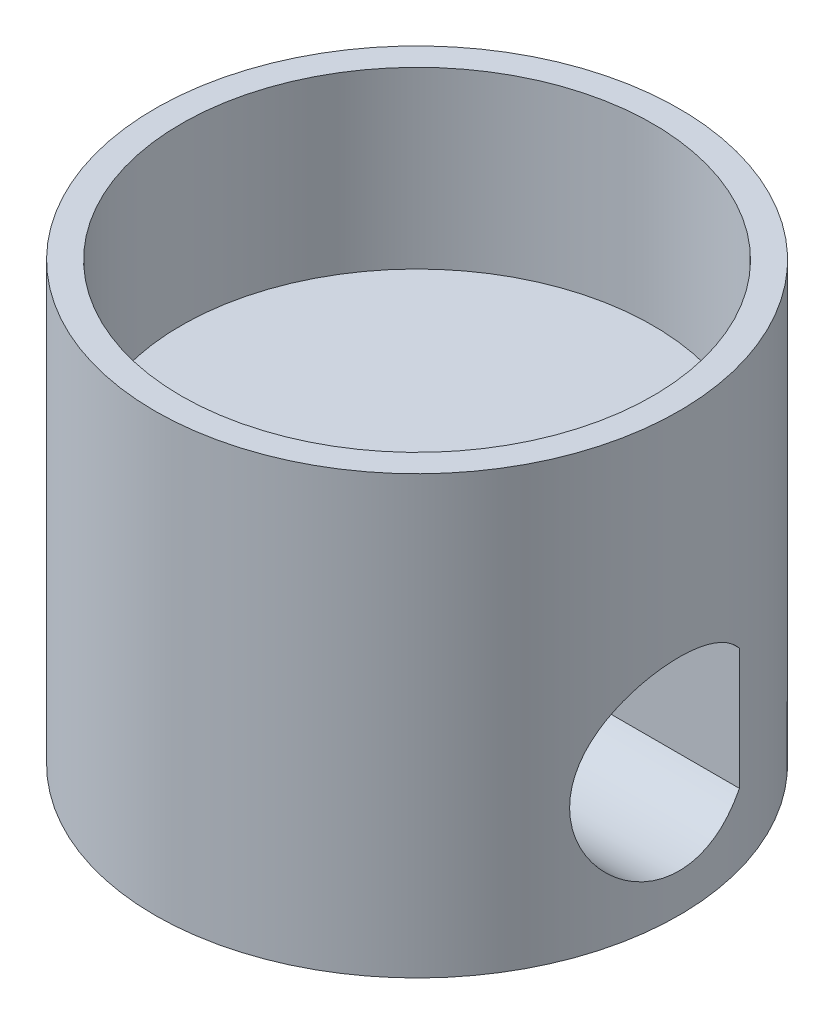
ISO-10303-21;
HEADER;
FILE_DESCRIPTION(('STEP AP214'),'2;1');
FILE_NAME('part.step','',(''),(''),'','','');
FILE_SCHEMA(('AUTOMOTIVE_DESIGN { 1 0 10303 214 1 1 1 1 }'));
ENDSEC;
DATA;
#1=APPLICATION_CONTEXT('core data for automotive mechanical design processes');
#2=APPLICATION_PROTOCOL_DEFINITION('international standard','automotive_design',2000,#1);
#3=PRODUCT_CONTEXT('',#1,'mechanical');
#4=PRODUCT('Part','Part','',(#3));
#5=PRODUCT_RELATED_PRODUCT_CATEGORY('part','',(#4));
#6=PRODUCT_DEFINITION_FORMATION('','',#4);
#7=PRODUCT_DEFINITION_CONTEXT('part definition',#1,'design');
#8=PRODUCT_DEFINITION('design','',#6,#7);
#9=PRODUCT_DEFINITION_SHAPE('','',#8);
#10=(LENGTH_UNIT() NAMED_UNIT(*) SI_UNIT(.MILLI.,.METRE.));
#11=(NAMED_UNIT(*) PLANE_ANGLE_UNIT() SI_UNIT($,.RADIAN.));
#12=(NAMED_UNIT(*) SI_UNIT($,.STERADIAN.) SOLID_ANGLE_UNIT());
#13=UNCERTAINTY_MEASURE_WITH_UNIT(LENGTH_MEASURE(1.E-05),#10,'distance_accuracy_value','');
#14=(GEOMETRIC_REPRESENTATION_CONTEXT(3) GLOBAL_UNCERTAINTY_ASSIGNED_CONTEXT((#13)) GLOBAL_UNIT_ASSIGNED_CONTEXT((#10,
#11,#12)) REPRESENTATION_CONTEXT('',''));
#15=CARTESIAN_POINT('',(0.,0.,0.));
#16=DIRECTION('',(0.,0.,1.));
#17=DIRECTION('',(1.,0.,0.));
#18=AXIS2_PLACEMENT_3D('',#15,#16,#17);
#19=CARTESIAN_POINT('',(0.,25.,0.));
#20=DIRECTION('',(0.,-1.,0.));
#21=DIRECTION('',(0.,0.,-1.));
#22=AXIS2_PLACEMENT_3D('',#19,#20,#21);
#23=CYLINDRICAL_SURFACE('',#22,15.);
#24=DIRECTION('',(0.,-1.,0.));
#25=VECTOR('',#24,1.);
#26=CARTESIAN_POINT('',(-14.456832294801,25.,-4.));
#27=LINE('',#26,#25);
#28=CARTESIAN_POINT('',(-14.456832294801,4.02293226985726,-4.));
#29=VERTEX_POINT('',#28);
#30=CARTESIAN_POINT('',(-14.456832294801,10.9770677301427,-4.));
#31=VERTEX_POINT('',#30);
#32=EDGE_CURVE('E11',#29,#31,#27,.F.);
#33=ORIENTED_EDGE('',*,*,#32,.T.);
#34=CARTESIAN_POINT('',(-14.456832294801,10.9770677301427,-4.));
#35=CARTESIAN_POINT('',(-14.4838123008884,11.0892365045034,-3.90250583243332));
#36=CARTESIAN_POINT('',(-14.5110225627413,11.1972626767375,-3.80030957930546));
#37=CARTESIAN_POINT('',(-14.5651751468478,11.4043998549254,-3.58716135127771));
#38=CARTESIAN_POINT('',(-14.5921174385638,11.5035098549239,-3.47620839105837));
#39=CARTESIAN_POINT('',(-14.6450433181712,11.6923164690028,-3.24602568302507));
#40=CARTESIAN_POINT('',(-14.6710252322394,11.7819971081709,-3.12678244014175));
#41=CARTESIAN_POINT('',(-14.7212791590907,11.9511327678717,-2.88091616818375));
#42=CARTESIAN_POINT('',(-14.7455512518441,12.0305882667891,-2.75429348476022));
#43=CARTESIAN_POINT('',(-14.7917549810737,12.1787797631095,-2.49428161022018));
#44=CARTESIAN_POINT('',(-14.8136834549555,12.247501331881,-2.3608836253124));
#45=CARTESIAN_POINT('',(-14.854560851509,12.3735547551419,-2.08830503918467));
#46=CARTESIAN_POINT('',(-14.8735086745254,12.4308824081043,-1.94912232762692));
#47=CARTESIAN_POINT('',(-14.9078520823987,12.533526682992,-1.66619944447957));
#48=CARTESIAN_POINT('',(-14.9232528094939,12.5788607064939,-1.52246621829637));
#49=CARTESIAN_POINT('',(-14.950096624007,12.6572033015814,-1.23125737417597));
#50=CARTESIAN_POINT('',(-14.9615383402892,12.6902076032933,-1.08378047862555));
#51=CARTESIAN_POINT('',(-14.9797802200167,12.7425560781397,-0.791712056892936));
#52=CARTESIAN_POINT('',(-14.9867344574462,12.7623545819762,-0.647211485004863));
#53=CARTESIAN_POINT('',(-14.9964558452749,12.7899769485004,-0.356929576286237));
#54=CARTESIAN_POINT('',(-14.9992230670751,12.7978010153875,-0.211148261338759));
#55=CARTESIAN_POINT('',(-15.000492876334,12.8013950241784,0.0805982124061213));
#56=CARTESIAN_POINT('',(-14.9989949590769,12.7971635394868,0.22656339091804));
#57=CARTESIAN_POINT('',(-14.9917753426645,12.7766864354187,0.517544604058008));
#58=CARTESIAN_POINT('',(-14.9860536102608,12.7604407214706,0.662560631205616));
#59=CARTESIAN_POINT('',(-14.970818131851,12.7168759802162,0.945500510210956));
#60=CARTESIAN_POINT('',(-14.9614441514247,12.6899645246714,1.08349491730737));
#61=CARTESIAN_POINT('',(-14.9391500169331,12.6253411722058,1.35668302369604));
#62=CARTESIAN_POINT('',(-14.9262286938688,12.5876257147328,1.49187578390488));
#63=CARTESIAN_POINT('',(-14.8971701939427,12.5017311137664,1.75849016403799));
#64=CARTESIAN_POINT('',(-14.881034170729,12.4535557234365,1.88991311751978));
#65=CARTESIAN_POINT('',(-14.8459454913375,12.3471238356303,2.14823995028713));
#66=CARTESIAN_POINT('',(-14.8269918220283,12.288863710777,2.27514218364279));
#67=CARTESIAN_POINT('',(-14.7655402690042,12.0963376640478,2.65429196044219));
#68=CARTESIAN_POINT('',(-14.7192199004776,11.9465046253527,2.89822049138691));
#69=CARTESIAN_POINT('',(-14.6211520545735,11.6102135763264,3.35818212221089));
#70=CARTESIAN_POINT('',(-14.569402639459,11.4237424682543,3.57420520026262));
#71=CARTESIAN_POINT('',(-14.4902247999179,11.114860251878,3.87881526540885));
#72=CARTESIAN_POINT('',(-14.4628843325308,11.0039313183024,3.97930534769087));
#73=CARTESIAN_POINT('',(-14.4088817440869,10.7738910744694,4.17061021185807));
#74=CARTESIAN_POINT('',(-14.3822193928549,10.6547825928222,4.2614283110224));
#75=CARTESIAN_POINT('',(-14.3303204439348,10.4090399541472,4.43282589104749));
#76=CARTESIAN_POINT('',(-14.3050845314616,10.2824022392535,4.5134004740832));
#77=CARTESIAN_POINT('',(-14.2568096429446,10.0224821925767,4.6636470452347));
#78=CARTESIAN_POINT('',(-14.2337697543711,9.88920265608715,4.7333235696821));
#79=CARTESIAN_POINT('',(-14.1905129165342,9.61633233384355,4.86147474653438));
#80=CARTESIAN_POINT('',(-14.1703061629376,9.47672103168525,4.91990920903525));
#81=CARTESIAN_POINT('',(-14.1334790820612,9.19264665205111,5.02472456035081));
#82=CARTESIAN_POINT('',(-14.1168572641421,9.04818562011247,5.07111046068113));
#83=CARTESIAN_POINT('',(-14.087759517458,8.75545626140265,5.15139374336652));
#84=CARTESIAN_POINT('',(-14.0752826519458,8.60718880304372,5.18529394764121));
#85=CARTESIAN_POINT('',(-14.0549126844831,8.30798473044529,5.24025689330107));
#86=CARTESIAN_POINT('',(-14.0470193090835,8.15704827599081,5.26132040052239));
#87=CARTESIAN_POINT('',(-14.036413474906,7.86239807456858,5.28954706097823));
#88=CARTESIAN_POINT('',(-14.0334313864397,7.71876293957962,5.29743399971945));
#89=CARTESIAN_POINT('',(-14.0318942737967,7.43125175953258,5.3015044184183));
#90=CARTESIAN_POINT('',(-14.0333407511353,7.28737564929979,5.29768392894529));
#91=CARTESIAN_POINT('',(-14.0406150329165,7.00058968298306,5.27837425150206));
#92=CARTESIAN_POINT('',(-14.0464407914383,6.85767940712628,5.26289051238368));
#93=CARTESIAN_POINT('',(-14.0622832520476,6.57376477531496,5.22041205180573));
#94=CARTESIAN_POINT('',(-14.0723015269193,6.43276115513869,5.1934130104127));
#95=CARTESIAN_POINT('',(-14.0958885344595,6.15747834910385,5.12904162166039));
#96=CARTESIAN_POINT('',(-14.1093542777182,6.02312035708168,5.09196852612983));
#97=CARTESIAN_POINT('',(-14.1395544363371,5.75805321716144,5.00749465074993));
#98=CARTESIAN_POINT('',(-14.1562900034036,5.6273453735226,4.96009023129223));
#99=CARTESIAN_POINT('',(-14.2107094035423,5.24196496237253,4.80292578835635));
#100=CARTESIAN_POINT('',(-14.2526254607996,4.99382107624841,4.67816399014173));
#101=CARTESIAN_POINT('',(-14.3453953281095,4.5100958421113,4.38567896359922));
#102=CARTESIAN_POINT('',(-14.3965731200486,4.27562821649131,4.2162339538695));
#103=CARTESIAN_POINT('',(-14.5010150504944,3.83738390129195,3.84164404426818));
#104=CARTESIAN_POINT('',(-14.5542798479908,3.63361700575513,3.63648779671634));
#105=CARTESIAN_POINT('',(-14.632850789187,3.35041153113009,3.30057836454582));
#106=CARTESIAN_POINT('',(-14.6594033806932,3.25794099273233,3.18085743685958));
#107=CARTESIAN_POINT('',(-14.7108516762294,3.08342850869108,2.9337249620367));
#108=CARTESIAN_POINT('',(-14.735747988604,3.00138272389055,2.8063162717409));
#109=CARTESIAN_POINT('',(-14.7831942667122,2.84831936468049,2.54457600344459));
#110=CARTESIAN_POINT('',(-14.8057435268056,2.77730510375208,2.41024236150695));
#111=CARTESIAN_POINT('',(-14.8478389143724,2.64694680041852,2.13564021664903));
#112=CARTESIAN_POINT('',(-14.8673863705918,2.58759759121263,1.99537437488385));
#113=CARTESIAN_POINT('',(-14.9025752921822,2.48211448149389,1.71264268313978));
#114=CARTESIAN_POINT('',(-14.9182855717989,2.4357451713958,1.57027326556769));
#115=CARTESIAN_POINT('',(-14.9458320779197,2.35516461473827,1.28182719038901));
#116=CARTESIAN_POINT('',(-14.9576699240554,2.32094828472322,1.13575211027936));
#117=CARTESIAN_POINT('',(-14.9771356026729,2.26499477738276,0.840966912814123));
#118=CARTESIAN_POINT('',(-14.9847638403399,2.2432563990156,0.692257050485424));
#119=CARTESIAN_POINT('',(-14.9955866052723,2.21248389052715,0.393370490918434));
#120=CARTESIAN_POINT('',(-14.9987813248526,2.20344920935104,0.243193857589592));
#121=CARTESIAN_POINT('',(-15.0005948303142,2.19831650255048,-0.0495677525735728));
#122=CARTESIAN_POINT('',(-14.9994434836337,2.2015686248034,-0.192140360924843));
#123=CARTESIAN_POINT('',(-14.9931038055205,2.2195423554334,-0.476520322180779));
#124=CARTESIAN_POINT('',(-14.9879141014679,2.23426786356601,-0.618327398379138));
#125=CARTESIAN_POINT('',(-14.9736372222696,2.27504303974967,-0.900040896765588));
#126=CARTESIAN_POINT('',(-14.9645516905963,2.30108793273014,-1.0399480947789));
#127=CARTESIAN_POINT('',(-14.9427186871888,2.364270252032,-1.31699453368518));
#128=CARTESIAN_POINT('',(-14.9299698759603,2.40141173606888,-1.45413274241783));
#129=CARTESIAN_POINT('',(-14.9012432241007,2.48615655238968,-1.7237165079916));
#130=CARTESIAN_POINT('',(-14.8852886849265,2.53368459473596,-1.85618825341071));
#131=CARTESIAN_POINT('',(-14.8504888551256,2.6389828113903,-2.11666136546643));
#132=CARTESIAN_POINT('',(-14.8316424062189,2.69675709101556,-2.24466091554904));
#133=CARTESIAN_POINT('',(-14.7915304266889,2.82208429734419,-2.49534239553762));
#134=CARTESIAN_POINT('',(-14.7702655146402,2.88963472478416,-2.61802567415868));
#135=CARTESIAN_POINT('',(-14.7258257050609,3.03405560450544,-2.85742889758789));
#136=CARTESIAN_POINT('',(-14.702650419363,3.11092795240285,-2.9741476226197));
#137=CARTESIAN_POINT('',(-14.6434679808212,3.31258820295125,-3.25549030428284));
#138=CARTESIAN_POINT('',(-14.6066443089895,3.44265540949998,-3.41619504255624));
#139=CARTESIAN_POINT('',(-14.5320110946295,3.72017423578329,-3.72094447524408));
#140=CARTESIAN_POINT('',(-14.4942037185646,3.86758981783163,-3.8650225161201));
#141=CARTESIAN_POINT('',(-14.456832294801,4.02293226985726,-4.));
#142=B_SPLINE_CURVE_WITH_KNOTS('',3,(#34,#35,#36,#37,#38,#39,#40,#41,#42,#43,#44,#45,#46,#47,
#48,#49,#50,#51,#52,#53,#54,#55,#56,#57,#58,#59,#60,#61,#62,#63,#64,#65,#66,#67,#68,#69,#70,#71,
#72,#73,#74,#75,#76,#77,#78,#79,#80,#81,#82,#83,#84,#85,#86,#87,#88,#89,#90,#91,#92,#93,#94,#95,
#96,#97,#98,#99,#100,#101,#102,#103,#104,#105,#106,#107,#108,#109,#110,#111,#112,#113,#114,#115,
#116,#117,#118,#119,#120,#121,#122,#123,#124,#125,#126,#127,#128,#129,#130,#131,#132,#133,#134,
#135,#136,#137,#138,#139,#140,#141),.UNSPECIFIED.,.F.,.F.,(4,2,2,2,2,2,2,2,2,2,2,2,2,2,2,2,2,2,
2,2,2,2,2,2,2,2,2,2,2,2,2,2,2,2,2,2,2,2,2,2,2,2,2,2,2,2,2,2,2,2,2,2,2,4),(0.,0.453009207643617,
0.906069461520975,1.35988531009279,1.81367991910056,2.26807936792049,2.7226460677351,
3.17654957336159,3.63061012372695,4.06810932876408,4.50560107307002,4.94314459017378,
5.38069155149838,5.80292061405586,6.2252889862531,6.64750605675727,7.06987531124816,
7.93579773407711,8.80203028053854,9.25804519939506,9.71390320794272,10.1699783667374,
10.6258631754847,11.083348643381,11.5406435175554,11.9978349739943,12.4549991517623,
12.886108920567,13.3173648743079,13.7484194782037,14.1796359334622,14.5992281246315,
15.0189683730055,15.8577930551412,16.7354584663659,17.6134032772673,18.0737033002016,
18.5338333126065,18.9941012657315,19.4541648906889,19.9052455149034,20.3561372343142,
20.8069855467106,21.257814301824,21.6851407394754,22.1126124869791,22.5399040807449,
22.9673521148309,23.391798785936,23.8164159041112,24.2409246604303,24.665519885983,
25.2940646041807,25.9213259615948),.UNSPECIFIED.);
#143=EDGE_CURVE('E41',#31,#29,#142,.T.);
#144=ORIENTED_EDGE('',*,*,#143,.T.);
#145=EDGE_LOOP('',(#33,#144));
#146=FACE_BOUND('',#145,.T.);
#147=DIRECTION('',(0.,-1.,0.));
#148=VECTOR('',#147,1.);
#149=CARTESIAN_POINT('',(14.456832294801,25.,-4.));
#150=LINE('',#149,#148);
#151=CARTESIAN_POINT('',(14.456832294801,10.9770677301427,-4.));
#152=VERTEX_POINT('',#151);
#153=CARTESIAN_POINT('',(14.456832294801,4.02293226985726,-4.));
#154=VERTEX_POINT('',#153);
#155=EDGE_CURVE('E63',#152,#154,#150,.T.);
#156=ORIENTED_EDGE('',*,*,#155,.T.);
#157=CARTESIAN_POINT('',(14.456832294801,4.02293226985726,-4.));
#158=CARTESIAN_POINT('',(14.4838123008884,3.91076349549658,-3.90250583243332));
#159=CARTESIAN_POINT('',(14.5110225627413,3.80273732326249,-3.80030957930546));
#160=CARTESIAN_POINT('',(14.5651751468478,3.59560014507457,-3.58716135127771));
#161=CARTESIAN_POINT('',(14.5921174385638,3.49649014507609,-3.47620839105836));
#162=CARTESIAN_POINT('',(14.6450433181712,3.30768353099723,-3.24602568302506));
#163=CARTESIAN_POINT('',(14.6710252322394,3.21800289182912,-3.12678244014175));
#164=CARTESIAN_POINT('',(14.7212791590907,3.04886723212825,-2.88091616818374));
#165=CARTESIAN_POINT('',(14.7455512518441,2.96941173321085,-2.75429348476022));
#166=CARTESIAN_POINT('',(14.7917549810737,2.82122023689054,-2.49428161022017));
#167=CARTESIAN_POINT('',(14.8136834549555,2.75249866811904,-2.3608836253124));
#168=CARTESIAN_POINT('',(14.854560851509,2.62644524485811,-2.08830503918467));
#169=CARTESIAN_POINT('',(14.8735086745254,2.56911759189566,-1.94912232762691));
#170=CARTESIAN_POINT('',(14.9078520823987,2.46647331700798,-1.66619944447957));
#171=CARTESIAN_POINT('',(14.9232528094939,2.42113929350606,-1.52246621829637));
#172=CARTESIAN_POINT('',(14.950096624007,2.34279669841861,-1.23125737417597));
#173=CARTESIAN_POINT('',(14.9615383402892,2.30979239670672,-1.08378047862554));
#174=CARTESIAN_POINT('',(14.9797802200167,2.25744392186028,-0.791712056892932));
#175=CARTESIAN_POINT('',(14.9867344574462,2.23764541802384,-0.647211485004859));
#176=CARTESIAN_POINT('',(14.9964558452749,2.21002305149964,-0.356929576286233));
#177=CARTESIAN_POINT('',(14.9992230670751,2.2021989846125,-0.211148261338755));
#178=CARTESIAN_POINT('',(15.000492876334,2.19860497582159,0.0805982124061248));
#179=CARTESIAN_POINT('',(14.9989949590769,2.20283646051321,0.226563390918043));
#180=CARTESIAN_POINT('',(14.9917753426645,2.22331356458128,0.517544604058011));
#181=CARTESIAN_POINT('',(14.9860536102608,2.2395592785294,0.662560631205619));
#182=CARTESIAN_POINT('',(14.970818131851,2.28312401978383,0.945500510210959));
#183=CARTESIAN_POINT('',(14.9614441514247,2.31003547532862,1.08349491730737));
#184=CARTESIAN_POINT('',(14.9391500169331,2.37465882779416,1.35668302369605));
#185=CARTESIAN_POINT('',(14.9262286938688,2.41237428526719,1.49187578390488));
#186=CARTESIAN_POINT('',(14.8971701939427,2.49826888623362,1.75849016403799));
#187=CARTESIAN_POINT('',(14.881034170729,2.54644427656349,1.88991311751978));
#188=CARTESIAN_POINT('',(14.8459454913375,2.65287616436968,2.14823995028713));
#189=CARTESIAN_POINT('',(14.8269918220283,2.71113628922303,2.27514218364279));
#190=CARTESIAN_POINT('',(14.7655402690042,2.90366233595216,2.65429196044219));
#191=CARTESIAN_POINT('',(14.7192199004776,3.05349537464729,2.89822049138692));
#192=CARTESIAN_POINT('',(14.6211520545735,3.38978642367365,3.35818212221089));
#193=CARTESIAN_POINT('',(14.569402639459,3.57625753174575,3.57420520026262));
#194=CARTESIAN_POINT('',(14.4902247999179,3.88513974812205,3.87881526540886));
#195=CARTESIAN_POINT('',(14.4628843325307,3.99606868169762,3.97930534769088));
#196=CARTESIAN_POINT('',(14.4088817440869,4.22610892553057,4.17061021185807));
#197=CARTESIAN_POINT('',(14.3822193928549,4.34521740717776,4.2614283110224));
#198=CARTESIAN_POINT('',(14.3303204439348,4.59096004585283,4.43282589104749));
#199=CARTESIAN_POINT('',(14.3050845314616,4.71759776074649,4.51340047408321));
#200=CARTESIAN_POINT('',(14.2568096429446,4.97751780742327,4.6636470452347));
#201=CARTESIAN_POINT('',(14.2337697543711,5.11079734391285,4.7333235696821));
#202=CARTESIAN_POINT('',(14.1905129165342,5.38366766615645,4.86147474653439));
#203=CARTESIAN_POINT('',(14.1703061629376,5.52327896831475,4.91990920903525));
#204=CARTESIAN_POINT('',(14.1334790820612,5.80735334794889,5.02472456035081));
#205=CARTESIAN_POINT('',(14.1168572641421,5.95181437988753,5.07111046068113));
#206=CARTESIAN_POINT('',(14.087759517458,6.24454373859735,5.15139374336652));
#207=CARTESIAN_POINT('',(14.0752826519458,6.39281119695628,5.18529394764121));
#208=CARTESIAN_POINT('',(14.0549126844831,6.69201526955471,5.24025689330107));
#209=CARTESIAN_POINT('',(14.0470193090835,6.84295172400919,5.26132040052239));
#210=CARTESIAN_POINT('',(14.036413474906,7.13760192543142,5.28954706097823));
#211=CARTESIAN_POINT('',(14.0334313864397,7.28123706042038,5.29743399971945));
#212=CARTESIAN_POINT('',(14.0318942737967,7.56874824046742,5.3015044184183));
#213=CARTESIAN_POINT('',(14.0333407511353,7.71262435070021,5.29768392894529));
#214=CARTESIAN_POINT('',(14.0406150329165,7.99941031701694,5.27837425150206));
#215=CARTESIAN_POINT('',(14.0464407914383,8.14232059287372,5.26289051238368));
#216=CARTESIAN_POINT('',(14.0622832520476,8.42623522468504,5.22041205180573));
#217=CARTESIAN_POINT('',(14.0723015269193,8.56723884486131,5.1934130104127));
#218=CARTESIAN_POINT('',(14.0958885344595,8.84252165089615,5.12904162166039));
#219=CARTESIAN_POINT('',(14.1093542777182,8.97687964291832,5.09196852612983));
#220=CARTESIAN_POINT('',(14.1395544363371,9.24194678283856,5.00749465074993));
#221=CARTESIAN_POINT('',(14.1562900034036,9.3726546264774,4.96009023129223));
#222=CARTESIAN_POINT('',(14.2107094035423,9.75803503762747,4.80292578835635));
#223=CARTESIAN_POINT('',(14.2526254607996,10.0061789237516,4.67816399014173));
#224=CARTESIAN_POINT('',(14.3453953281095,10.4899041578887,4.38567896359922));
#225=CARTESIAN_POINT('',(14.3965731200486,10.7243717835087,4.2162339538695));
#226=CARTESIAN_POINT('',(14.5010150504944,11.1626160987081,3.84164404426818));
#227=CARTESIAN_POINT('',(14.5542798479908,11.3663829942449,3.63648779671634));
#228=CARTESIAN_POINT('',(14.632850789187,11.6495884688699,3.30057836454581));
#229=CARTESIAN_POINT('',(14.6594033806932,11.7420590072677,3.18085743685958));
#230=CARTESIAN_POINT('',(14.7108516762294,11.9165714913089,2.9337249620367));
#231=CARTESIAN_POINT('',(14.735747988604,11.9986172761095,2.8063162717409));
#232=CARTESIAN_POINT('',(14.7831942667122,12.1516806353195,2.54457600344458));
#233=CARTESIAN_POINT('',(14.8057435268056,12.2226948962479,2.41024236150694));
#234=CARTESIAN_POINT('',(14.8478389143724,12.3530531995815,2.13564021664903));
#235=CARTESIAN_POINT('',(14.8673863705918,12.4124024087874,1.99537437488385));
#236=CARTESIAN_POINT('',(14.9025752921822,12.5178855185061,1.71264268313978));
#237=CARTESIAN_POINT('',(14.9182855717989,12.5642548286042,1.57027326556769));
#238=CARTESIAN_POINT('',(14.9458320779197,12.6448353852617,1.28182719038901));
#239=CARTESIAN_POINT('',(14.9576699240554,12.6790517152768,1.13575211027936));
#240=CARTESIAN_POINT('',(14.9771356026729,12.7350052226172,0.840966912814123));
#241=CARTESIAN_POINT('',(14.9847638403399,12.7567436009844,0.692257050485424));
#242=CARTESIAN_POINT('',(14.9955866052723,12.7875161094729,0.393370490918434));
#243=CARTESIAN_POINT('',(14.9987813248526,12.796550790649,0.243193857589592));
#244=CARTESIAN_POINT('',(15.0005948303142,12.8016834974495,-0.0495677525735726));
#245=CARTESIAN_POINT('',(14.9994434836337,12.7984313751966,-0.192140360924843));
#246=CARTESIAN_POINT('',(14.9931038055205,12.7804576445666,-0.476520322180779));
#247=CARTESIAN_POINT('',(14.9879141014679,12.765732136434,-0.618327398379138));
#248=CARTESIAN_POINT('',(14.9736372222696,12.7249569602503,-0.900040896765588));
#249=CARTESIAN_POINT('',(14.9645516905963,12.6989120672699,-1.0399480947789));
#250=CARTESIAN_POINT('',(14.9427186871888,12.635729747968,-1.31699453368518));
#251=CARTESIAN_POINT('',(14.9299698759603,12.5985882639311,-1.45413274241783));
#252=CARTESIAN_POINT('',(14.9012432241007,12.5138434476103,-1.72371650799159));
#253=CARTESIAN_POINT('',(14.8852886849265,12.466315405264,-1.85618825341071));
#254=CARTESIAN_POINT('',(14.8504888551256,12.3610171886097,-2.11666136546643));
#255=CARTESIAN_POINT('',(14.8316424062189,12.3032429089844,-2.24466091554904));
#256=CARTESIAN_POINT('',(14.7915304266889,12.1779157026558,-2.49534239553762));
#257=CARTESIAN_POINT('',(14.7702655146402,12.1103652752158,-2.61802567415868));
#258=CARTESIAN_POINT('',(14.7258257050609,11.9659443954946,-2.85742889758789));
#259=CARTESIAN_POINT('',(14.702650419363,11.8890720475971,-2.9741476226197));
#260=CARTESIAN_POINT('',(14.6434679808212,11.6874117970488,-3.25549030428284));
#261=CARTESIAN_POINT('',(14.6066443089895,11.5573445905,-3.41619504255624));
#262=CARTESIAN_POINT('',(14.5320110946295,11.2798257642167,-3.72094447524408));
#263=CARTESIAN_POINT('',(14.4942037185646,11.1324101821684,-3.8650225161201));
#264=CARTESIAN_POINT('',(14.456832294801,10.9770677301427,-4.));
#265=B_SPLINE_CURVE_WITH_KNOTS('',3,(#157,#158,#159,#160,#161,#162,#163,#164,#165,#166,#167,
#168,#169,#170,#171,#172,#173,#174,#175,#176,#177,#178,#179,#180,#181,#182,#183,#184,#185,#186,
#187,#188,#189,#190,#191,#192,#193,#194,#195,#196,#197,#198,#199,#200,#201,#202,#203,#204,#205,
#206,#207,#208,#209,#210,#211,#212,#213,#214,#215,#216,#217,#218,#219,#220,#221,#222,#223,#224,
#225,#226,#227,#228,#229,#230,#231,#232,#233,#234,#235,#236,#237,#238,#239,#240,#241,#242,#243,
#244,#245,#246,#247,#248,#249,#250,#251,#252,#253,#254,#255,#256,#257,#258,#259,#260,#261,#262,
#263,#264),.UNSPECIFIED.,.F.,.F.,(4,2,2,2,2,2,2,2,2,2,2,2,2,2,2,2,2,2,2,2,2,2,2,2,2,2,2,2,2,2,2,
2,2,2,2,2,2,2,2,2,2,2,2,2,2,2,2,2,2,2,2,2,2,4),(0.,0.453009207643619,0.906069461520975,
1.3598853100928,1.81367991910056,2.26807936792049,2.7226460677351,3.17654957336159,
3.63061012372695,4.06810932876408,4.50560107307002,4.94314459017378,5.38069155149838,
5.80292061405586,6.22528898625311,6.64750605675728,7.06987531124817,7.93579773407712,
8.80203028053854,9.25804519939506,9.71390320794272,10.1699783667374,10.6258631754847,
11.083348643381,11.5406435175554,11.9978349739943,12.4549991517623,12.886108920567,
13.3173648743079,13.7484194782037,14.1796359334622,14.5992281246315,15.0189683730055,
15.8577930551412,16.7354584663659,17.6134032772673,18.0737033002016,18.5338333126065,
18.9941012657315,19.4541648906889,19.9052455149034,20.3561372343142,20.8069855467106,
21.2578143018241,21.6851407394754,22.1126124869792,22.5399040807449,22.9673521148309,
23.391798785936,23.8164159041112,24.2409246604303,24.665519885983,25.2940646041807,
25.9213259615948),.UNSPECIFIED.);
#266=EDGE_CURVE('E59',#154,#152,#265,.T.);
#267=ORIENTED_EDGE('',*,*,#266,.T.);
#268=EDGE_LOOP('',(#156,#267));
#269=FACE_BOUND('',#268,.T.);
#270=CARTESIAN_POINT('',(0.,25.,0.));
#271=DIRECTION('',(0.,1.,0.));
#272=DIRECTION('',(0.,0.,1.));
#273=AXIS2_PLACEMENT_3D('',#270,#271,#272);
#274=CIRCLE('',#273,15.);
#275=CARTESIAN_POINT('',(0.,25.,15.));
#276=VERTEX_POINT('',#275);
#277=EDGE_CURVE('E64',#276,#276,#274,.T.);
#278=ORIENTED_EDGE('',*,*,#277,.F.);
#279=EDGE_LOOP('',(#278));
#280=FACE_BOUND('',#279,.T.);
#281=CARTESIAN_POINT('',(0.,0.,0.));
#282=DIRECTION('',(0.,1.,0.));
#283=DIRECTION('',(0.,0.,1.));
#284=AXIS2_PLACEMENT_3D('',#281,#282,#283);
#285=CIRCLE('',#284,15.);
#286=CARTESIAN_POINT('',(0.,0.,15.));
#287=VERTEX_POINT('',#286);
#288=EDGE_CURVE('E115',#287,#287,#285,.T.);
#289=ORIENTED_EDGE('',*,*,#288,.T.);
#290=EDGE_LOOP('',(#289));
#291=FACE_BOUND('',#290,.T.);
#292=ADVANCED_FACE('F33',(#146,#269,#280,#291),#23,.T.);
#293=CARTESIAN_POINT('',(0.,25.,0.));
#294=DIRECTION('',(0.,1.,0.));
#295=DIRECTION('',(0.,0.,1.));
#296=AXIS2_PLACEMENT_3D('',#293,#294,#295);
#297=PLANE('',#296);
#298=CARTESIAN_POINT('',(0.,25.,0.));
#299=DIRECTION('',(0.,1.,0.));
#300=DIRECTION('',(0.,0.,1.));
#301=AXIS2_PLACEMENT_3D('',#298,#299,#300);
#302=CIRCLE('',#301,13.5);
#303=CARTESIAN_POINT('',(0.,25.,13.5));
#304=VERTEX_POINT('',#303);
#305=EDGE_CURVE('E69',#304,#304,#302,.T.);
#306=ORIENTED_EDGE('',*,*,#305,.F.);
#307=EDGE_LOOP('',(#306));
#308=FACE_BOUND('',#307,.T.);
#309=ORIENTED_EDGE('',*,*,#277,.T.);
#310=EDGE_LOOP('',(#309));
#311=FACE_BOUND('',#310,.T.);
#312=ADVANCED_FACE('F98',(#308,#311),#297,.T.);
#313=CARTESIAN_POINT('',(0.,0.,0.));
#314=DIRECTION('',(0.,1.,0.));
#315=DIRECTION('',(0.,0.,1.));
#316=AXIS2_PLACEMENT_3D('',#313,#314,#315);
#317=PLANE('',#316);
#318=ORIENTED_EDGE('',*,*,#288,.F.);
#319=EDGE_LOOP('',(#318));
#320=FACE_BOUND('',#319,.T.);
#321=ADVANCED_FACE('F96',(#320),#317,.F.);
#322=CARTESIAN_POINT('',(0.,15.,0.));
#323=DIRECTION('',(0.,1.,0.));
#324=DIRECTION('',(0.,0.,1.));
#325=AXIS2_PLACEMENT_3D('',#322,#323,#324);
#326=CYLINDRICAL_SURFACE('',#325,13.5);
#327=CARTESIAN_POINT('',(0.,15.,0.));
#328=DIRECTION('',(0.,1.,0.));
#329=DIRECTION('',(0.,0.,1.));
#330=AXIS2_PLACEMENT_3D('',#327,#328,#329);
#331=CIRCLE('',#330,13.5);
#332=CARTESIAN_POINT('',(0.,15.,13.5));
#333=VERTEX_POINT('',#332);
#334=EDGE_CURVE('E112',#333,#333,#331,.T.);
#335=ORIENTED_EDGE('',*,*,#334,.F.);
#336=EDGE_LOOP('',(#335));
#337=FACE_BOUND('',#336,.T.);
#338=ORIENTED_EDGE('',*,*,#305,.T.);
#339=EDGE_LOOP('',(#338));
#340=FACE_BOUND('',#339,.T.);
#341=ADVANCED_FACE('F92',(#337,#340),#326,.F.);
#342=CARTESIAN_POINT('',(0.,15.,0.));
#343=DIRECTION('',(0.,1.,0.));
#344=DIRECTION('',(0.,0.,1.));
#345=AXIS2_PLACEMENT_3D('',#342,#343,#344);
#346=PLANE('',#345);
#347=ORIENTED_EDGE('',*,*,#334,.T.);
#348=EDGE_LOOP('',(#347));
#349=FACE_BOUND('',#348,.T.);
#350=ADVANCED_FACE('F89',(#349),#346,.T.);
#351=CARTESIAN_POINT('',(-15.,0.,-4.));
#352=DIRECTION('',(0.,0.,-1.));
#353=DIRECTION('',(-1.,0.,0.));
#354=AXIS2_PLACEMENT_3D('',#351,#352,#353);
#355=PLANE('',#354);
#356=DIRECTION('',(1.,0.,0.));
#357=VECTOR('',#356,1.);
#358=CARTESIAN_POINT('',(-15.,10.9770677301427,-4.));
#359=LINE('',#358,#357);
#360=EDGE_CURVE('E53',#31,#152,#359,.T.);
#361=ORIENTED_EDGE('',*,*,#360,.F.);
#362=ORIENTED_EDGE('',*,*,#32,.F.);
#363=DIRECTION('',(1.,0.,0.));
#364=VECTOR('',#363,1.);
#365=CARTESIAN_POINT('',(-15.,4.02293226985726,-4.));
#366=LINE('',#365,#364);
#367=EDGE_CURVE('E48',#29,#154,#366,.T.);
#368=ORIENTED_EDGE('',*,*,#367,.T.);
#369=ORIENTED_EDGE('',*,*,#155,.F.);
#370=EDGE_LOOP('',(#361,#362,#368,#369));
#371=FACE_BOUND('',#370,.T.);
#372=ADVANCED_FACE('F67',(#371),#355,.F.);
#373=CARTESIAN_POINT('',(-15.,7.5,0.));
#374=DIRECTION('',(1.,0.,0.));
#375=DIRECTION('',(0.,0.,-1.));
#376=AXIS2_PLACEMENT_3D('',#373,#374,#375);
#377=CYLINDRICAL_SURFACE('',#376,5.3);
#378=ORIENTED_EDGE('',*,*,#367,.F.);
#379=ORIENTED_EDGE('',*,*,#143,.F.);
#380=ORIENTED_EDGE('',*,*,#360,.T.);
#381=ORIENTED_EDGE('',*,*,#266,.F.);
#382=EDGE_LOOP('',(#378,#379,#380,#381));
#383=FACE_BOUND('',#382,.T.);
#384=ADVANCED_FACE('F60',(#383),#377,.F.);
#385=CLOSED_SHELL('',(#292,#312,#321,#341,#350,#372,#384));
#386=MANIFOLD_SOLID_BREP('B2',#385);
#387=ADVANCED_BREP_SHAPE_REPRESENTATION('',(#18,#386),#14);
#388=SHAPE_DEFINITION_REPRESENTATION(#9,#387);
ENDSEC;
END-ISO-10303-21;
